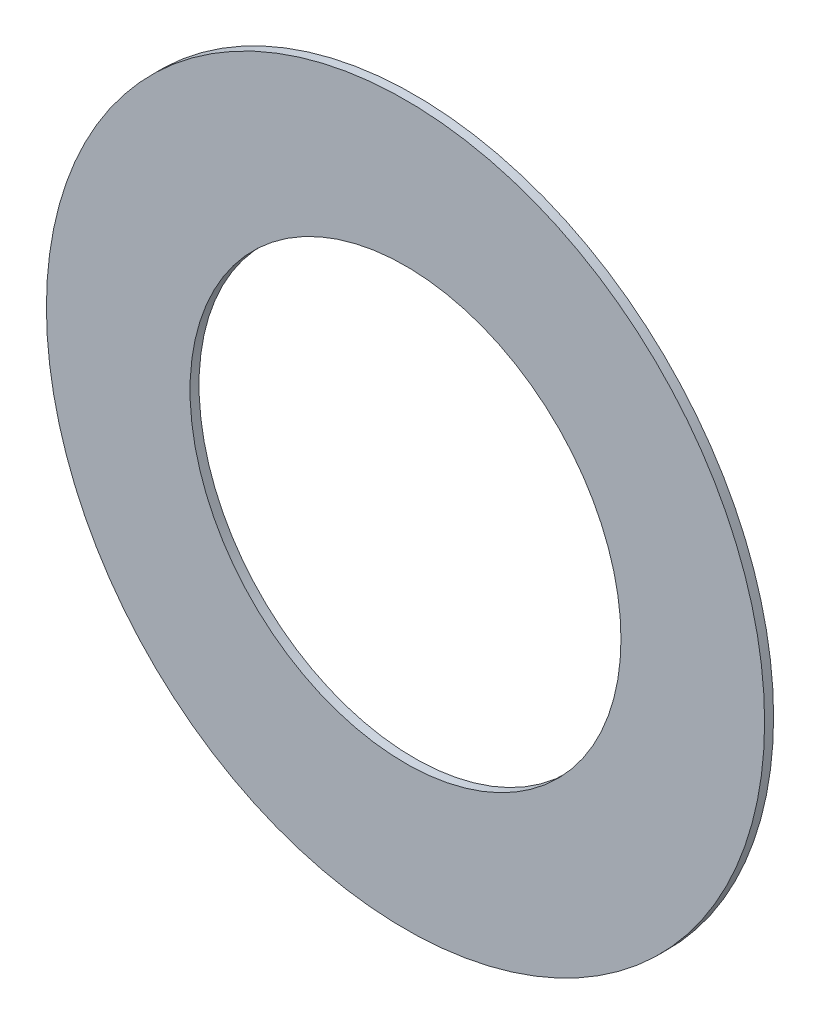
ISO-10303-21;
HEADER;
FILE_DESCRIPTION(('STEP AP214'),'2;1');
FILE_NAME('part.step','',(''),(''),'','','');
FILE_SCHEMA(('AUTOMOTIVE_DESIGN { 1 0 10303 214 1 1 1 1 }'));
ENDSEC;
DATA;
#1=APPLICATION_CONTEXT('core data for automotive mechanical design processes');
#2=APPLICATION_PROTOCOL_DEFINITION('international standard','automotive_design',2000,#1);
#3=PRODUCT_CONTEXT('',#1,'mechanical');
#4=PRODUCT('Part','Part','',(#3));
#5=PRODUCT_RELATED_PRODUCT_CATEGORY('part','',(#4));
#6=PRODUCT_DEFINITION_FORMATION('','',#4);
#7=PRODUCT_DEFINITION_CONTEXT('part definition',#1,'design');
#8=PRODUCT_DEFINITION('design','',#6,#7);
#9=PRODUCT_DEFINITION_SHAPE('','',#8);
#10=(LENGTH_UNIT() NAMED_UNIT(*) SI_UNIT(.MILLI.,.METRE.));
#11=(NAMED_UNIT(*) PLANE_ANGLE_UNIT() SI_UNIT($,.RADIAN.));
#12=(NAMED_UNIT(*) SI_UNIT($,.STERADIAN.) SOLID_ANGLE_UNIT());
#13=UNCERTAINTY_MEASURE_WITH_UNIT(LENGTH_MEASURE(1.E-05),#10,'distance_accuracy_value','');
#14=(GEOMETRIC_REPRESENTATION_CONTEXT(3) GLOBAL_UNCERTAINTY_ASSIGNED_CONTEXT((#13)) GLOBAL_UNIT_ASSIGNED_CONTEXT((#10,
#11,#12)) REPRESENTATION_CONTEXT('',''));
#15=CARTESIAN_POINT('',(0.,0.,0.));
#16=DIRECTION('',(0.,0.,1.));
#17=DIRECTION('',(1.,0.,0.));
#18=AXIS2_PLACEMENT_3D('',#15,#16,#17);
#19=CARTESIAN_POINT('',(0.,0.,3.175));
#20=DIRECTION('',(0.,0.,1.));
#21=DIRECTION('',(1.,0.,0.));
#22=AXIS2_PLACEMENT_3D('',#19,#20,#21);
#23=PLANE('',#22);
#24=CARTESIAN_POINT('',(0.,0.,3.175));
#25=DIRECTION('',(0.,0.,1.));
#26=DIRECTION('',(1.,0.,0.));
#27=AXIS2_PLACEMENT_3D('',#24,#25,#26);
#28=CIRCLE('',#27,127.);
#29=CARTESIAN_POINT('',(127.,0.,3.175));
#30=VERTEX_POINT('',#29);
#31=EDGE_CURVE('E10',#30,#30,#28,.T.);
#32=ORIENTED_EDGE('',*,*,#31,.T.);
#33=EDGE_LOOP('',(#32));
#34=FACE_BOUND('',#33,.T.);
#35=CARTESIAN_POINT('',(0.,0.,3.175));
#36=DIRECTION('',(0.,0.,1.));
#37=DIRECTION('',(1.,0.,0.));
#38=AXIS2_PLACEMENT_3D('',#35,#36,#37);
#39=CIRCLE('',#38,76.2);
#40=CARTESIAN_POINT('',(76.2,0.,3.175));
#41=VERTEX_POINT('',#40);
#42=EDGE_CURVE('E42',#41,#41,#39,.T.);
#43=ORIENTED_EDGE('',*,*,#42,.F.);
#44=EDGE_LOOP('',(#43));
#45=FACE_BOUND('',#44,.T.);
#46=ADVANCED_FACE('F31',(#34,#45),#23,.T.);
#47=CARTESIAN_POINT('',(0.,0.,0.));
#48=DIRECTION('',(0.,0.,1.));
#49=DIRECTION('',(1.,0.,0.));
#50=AXIS2_PLACEMENT_3D('',#47,#48,#49);
#51=PLANE('',#50);
#52=CARTESIAN_POINT('',(0.,0.,0.));
#53=DIRECTION('',(0.,0.,1.));
#54=DIRECTION('',(1.,0.,0.));
#55=AXIS2_PLACEMENT_3D('',#52,#53,#54);
#56=CIRCLE('',#55,127.);
#57=CARTESIAN_POINT('',(127.,0.,0.));
#58=VERTEX_POINT('',#57);
#59=EDGE_CURVE('E35',#58,#58,#56,.T.);
#60=ORIENTED_EDGE('',*,*,#59,.F.);
#61=EDGE_LOOP('',(#60));
#62=FACE_BOUND('',#61,.T.);
#63=CARTESIAN_POINT('',(0.,0.,0.));
#64=DIRECTION('',(0.,0.,1.));
#65=DIRECTION('',(1.,0.,0.));
#66=AXIS2_PLACEMENT_3D('',#63,#64,#65);
#67=CIRCLE('',#66,76.2);
#68=CARTESIAN_POINT('',(76.2,0.,0.));
#69=VERTEX_POINT('',#68);
#70=EDGE_CURVE('E44',#69,#69,#67,.T.);
#71=ORIENTED_EDGE('',*,*,#70,.T.);
#72=EDGE_LOOP('',(#71));
#73=FACE_BOUND('',#72,.T.);
#74=ADVANCED_FACE('F54',(#62,#73),#51,.F.);
#75=CARTESIAN_POINT('',(0.,0.,3.175));
#76=DIRECTION('',(0.,0.,-1.));
#77=DIRECTION('',(-1.,0.,0.));
#78=AXIS2_PLACEMENT_3D('',#75,#76,#77);
#79=CYLINDRICAL_SURFACE('',#78,127.);
#80=ORIENTED_EDGE('',*,*,#31,.F.);
#81=EDGE_LOOP('',(#80));
#82=FACE_BOUND('',#81,.T.);
#83=ORIENTED_EDGE('',*,*,#59,.T.);
#84=EDGE_LOOP('',(#83));
#85=FACE_BOUND('',#84,.T.);
#86=ADVANCED_FACE('F33',(#82,#85),#79,.T.);
#87=CARTESIAN_POINT('',(0.,0.,3.175));
#88=DIRECTION('',(0.,0.,-1.));
#89=DIRECTION('',(-1.,0.,0.));
#90=AXIS2_PLACEMENT_3D('',#87,#88,#89);
#91=CYLINDRICAL_SURFACE('',#90,76.2);
#92=ORIENTED_EDGE('',*,*,#42,.T.);
#93=EDGE_LOOP('',(#92));
#94=FACE_BOUND('',#93,.T.);
#95=ORIENTED_EDGE('',*,*,#70,.F.);
#96=EDGE_LOOP('',(#95));
#97=FACE_BOUND('',#96,.T.);
#98=ADVANCED_FACE('F50',(#94,#97),#91,.F.);
#99=CLOSED_SHELL('',(#46,#74,#86,#98));
#100=MANIFOLD_SOLID_BREP('B2',#99);
#101=ADVANCED_BREP_SHAPE_REPRESENTATION('',(#18,#100),#14);
#102=SHAPE_DEFINITION_REPRESENTATION(#9,#101);
ENDSEC;
END-ISO-10303-21;
